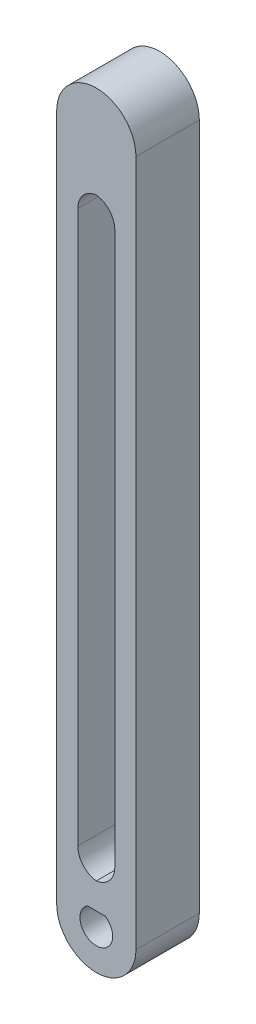
ISO-10303-21;
HEADER;
FILE_DESCRIPTION(('STEP AP214'),'2;1');
FILE_NAME('part.step','',(''),(''),'','','');
FILE_SCHEMA(('AUTOMOTIVE_DESIGN { 1 0 10303 214 1 1 1 1 }'));
ENDSEC;
DATA;
#1=APPLICATION_CONTEXT('core data for automotive mechanical design processes');
#2=APPLICATION_PROTOCOL_DEFINITION('international standard','automotive_design',2000,#1);
#3=PRODUCT_CONTEXT('',#1,'mechanical');
#4=PRODUCT('Part','Part','',(#3));
#5=PRODUCT_RELATED_PRODUCT_CATEGORY('part','',(#4));
#6=PRODUCT_DEFINITION_FORMATION('','',#4);
#7=PRODUCT_DEFINITION_CONTEXT('part definition',#1,'design');
#8=PRODUCT_DEFINITION('design','',#6,#7);
#9=PRODUCT_DEFINITION_SHAPE('','',#8);
#10=(LENGTH_UNIT() NAMED_UNIT(*) SI_UNIT(.MILLI.,.METRE.));
#11=(NAMED_UNIT(*) PLANE_ANGLE_UNIT() SI_UNIT($,.RADIAN.));
#12=(NAMED_UNIT(*) SI_UNIT($,.STERADIAN.) SOLID_ANGLE_UNIT());
#13=UNCERTAINTY_MEASURE_WITH_UNIT(LENGTH_MEASURE(1.E-05),#10,'distance_accuracy_value','');
#14=(GEOMETRIC_REPRESENTATION_CONTEXT(3) GLOBAL_UNCERTAINTY_ASSIGNED_CONTEXT((#13)) GLOBAL_UNIT_ASSIGNED_CONTEXT((#10,
#11,#12)) REPRESENTATION_CONTEXT('',''));
#15=CARTESIAN_POINT('',(0.,0.,0.));
#16=DIRECTION('',(0.,0.,1.));
#17=DIRECTION('',(1.,0.,0.));
#18=AXIS2_PLACEMENT_3D('',#15,#16,#17);
#19=CARTESIAN_POINT('',(1.85483870967741,102.58064516129,12.));
#20=DIRECTION('',(0.,0.,-1.));
#21=DIRECTION('',(-1.,0.,0.));
#22=AXIS2_PLACEMENT_3D('',#19,#20,#21);
#23=CYLINDRICAL_SURFACE('',#22,7.5);
#24=CARTESIAN_POINT('',(1.85483870967741,102.58064516129,0.));
#25=DIRECTION('',(0.,0.,1.));
#26=DIRECTION('',(-1.,0.,0.));
#27=AXIS2_PLACEMENT_3D('',#24,#25,#26);
#28=CIRCLE('',#27,7.5);
#29=CARTESIAN_POINT('',(9.35483870967741,102.58064516129,0.));
#30=VERTEX_POINT('',#29);
#31=CARTESIAN_POINT('',(-5.64516129032259,102.58064516129,0.));
#32=VERTEX_POINT('',#31);
#33=EDGE_CURVE('E151',#30,#32,#28,.T.);
#34=ORIENTED_EDGE('',*,*,#33,.T.);
#35=DIRECTION('',(0.,0.,-1.));
#36=VECTOR('',#35,1.);
#37=CARTESIAN_POINT('',(-5.64516129032259,102.58064516129,12.));
#38=LINE('',#37,#36);
#39=CARTESIAN_POINT('',(-5.64516129032259,102.58064516129,12.));
#40=VERTEX_POINT('',#39);
#41=EDGE_CURVE('E188',#40,#32,#38,.T.);
#42=ORIENTED_EDGE('',*,*,#41,.F.);
#43=CARTESIAN_POINT('',(1.85483870967741,102.58064516129,12.));
#44=DIRECTION('',(0.,0.,1.));
#45=DIRECTION('',(-1.,0.,0.));
#46=AXIS2_PLACEMENT_3D('',#43,#44,#45);
#47=CIRCLE('',#46,7.5);
#48=CARTESIAN_POINT('',(9.35483870967741,102.58064516129,12.));
#49=VERTEX_POINT('',#48);
#50=EDGE_CURVE('E162',#49,#40,#47,.T.);
#51=ORIENTED_EDGE('',*,*,#50,.F.);
#52=DIRECTION('',(0.,0.,-1.));
#53=VECTOR('',#52,1.);
#54=CARTESIAN_POINT('',(9.35483870967741,102.58064516129,12.));
#55=LINE('',#54,#53);
#56=EDGE_CURVE('E172',#49,#30,#55,.T.);
#57=ORIENTED_EDGE('',*,*,#56,.T.);
#58=EDGE_LOOP('',(#34,#42,#51,#57));
#59=FACE_BOUND('',#58,.T.);
#60=ADVANCED_FACE('F45',(#59),#23,.T.);
#61=CARTESIAN_POINT('',(-5.64516129032259,102.58064516129,12.));
#62=DIRECTION('',(1.,0.,0.));
#63=DIRECTION('',(0.,1.,0.));
#64=AXIS2_PLACEMENT_3D('',#61,#62,#63);
#65=PLANE('',#64);
#66=CARTESIAN_POINT('',(-5.64516129032259,78.768969581459,6.));
#67=DIRECTION('',(-1.,0.,0.));
#68=DIRECTION('',(0.,-1.,0.));
#69=AXIS2_PLACEMENT_3D('',#66,#67,#68);
#70=CIRCLE('',#69,5.15);
#71=CARTESIAN_POINT('',(-5.64516129032259,73.618969581459,6.));
#72=VERTEX_POINT('',#71);
#73=EDGE_CURVE('E420',#72,#72,#70,.T.);
#74=ORIENTED_EDGE('',*,*,#73,.F.);
#75=EDGE_LOOP('',(#74));
#76=FACE_BOUND('',#75,.T.);
#77=CARTESIAN_POINT('',(-5.64516129032258,53.768969581459,6.00000000000026));
#78=DIRECTION('',(-1.,0.,0.));
#79=DIRECTION('',(0.,-1.,0.));
#80=AXIS2_PLACEMENT_3D('',#77,#78,#79);
#81=CIRCLE('',#80,5.15);
#82=CARTESIAN_POINT('',(-5.64516129032258,48.618969581459,6.00000000000026));
#83=VERTEX_POINT('',#82);
#84=EDGE_CURVE('E423',#83,#83,#81,.T.);
#85=ORIENTED_EDGE('',*,*,#84,.F.);
#86=EDGE_LOOP('',(#85));
#87=FACE_BOUND('',#86,.T.);
#88=CARTESIAN_POINT('',(-5.64516129032258,28.768969581459,6.00000000000052));
#89=DIRECTION('',(-1.,0.,0.));
#90=DIRECTION('',(0.,-1.,0.));
#91=AXIS2_PLACEMENT_3D('',#88,#89,#90);
#92=CIRCLE('',#91,5.15);
#93=CARTESIAN_POINT('',(-5.64516129032258,23.618969581459,6.00000000000052));
#94=VERTEX_POINT('',#93);
#95=EDGE_CURVE('E219',#94,#94,#92,.T.);
#96=ORIENTED_EDGE('',*,*,#95,.F.);
#97=EDGE_LOOP('',(#96));
#98=FACE_BOUND('',#97,.T.);
#99=DIRECTION('',(0.,-1.,0.));
#100=VECTOR('',#99,1.);
#101=CARTESIAN_POINT('',(-5.64516129032259,102.58064516129,0.));
#102=LINE('',#101,#100);
#103=CARTESIAN_POINT('',(-5.64516129032258,-27.4193548387097,0.));
#104=VERTEX_POINT('',#103);
#105=EDGE_CURVE('E175',#32,#104,#102,.T.);
#106=ORIENTED_EDGE('',*,*,#105,.T.);
#107=DIRECTION('',(0.,0.,-1.));
#108=VECTOR('',#107,1.);
#109=CARTESIAN_POINT('',(-5.64516129032258,-27.4193548387097,12.));
#110=LINE('',#109,#108);
#111=CARTESIAN_POINT('',(-5.64516129032258,-27.4193548387097,12.));
#112=VERTEX_POINT('',#111);
#113=EDGE_CURVE('E185',#112,#104,#110,.T.);
#114=ORIENTED_EDGE('',*,*,#113,.F.);
#115=DIRECTION('',(0.,-1.,0.));
#116=VECTOR('',#115,1.);
#117=CARTESIAN_POINT('',(-5.64516129032259,102.58064516129,12.));
#118=LINE('',#117,#116);
#119=EDGE_CURVE('E165',#40,#112,#118,.T.);
#120=ORIENTED_EDGE('',*,*,#119,.F.);
#121=ORIENTED_EDGE('',*,*,#41,.T.);
#122=EDGE_LOOP('',(#106,#114,#120,#121));
#123=FACE_BOUND('',#122,.T.);
#124=ADVANCED_FACE('F269',(#76,#87,#98,#123),#65,.F.);
#125=CARTESIAN_POINT('',(1.85483870967743,-27.4193548387097,12.));
#126=DIRECTION('',(0.,0.,-1.));
#127=DIRECTION('',(-1.,0.,0.));
#128=AXIS2_PLACEMENT_3D('',#125,#126,#127);
#129=CYLINDRICAL_SURFACE('',#128,7.5);
#130=CARTESIAN_POINT('',(1.85483870967743,-27.4193548387097,0.));
#131=DIRECTION('',(0.,0.,1.));
#132=DIRECTION('',(1.,0.,0.));
#133=AXIS2_PLACEMENT_3D('',#130,#131,#132);
#134=CIRCLE('',#133,7.5);
#135=CARTESIAN_POINT('',(9.35483870967743,-27.4193548387097,0.));
#136=VERTEX_POINT('',#135);
#137=EDGE_CURVE('E177',#104,#136,#134,.T.);
#138=ORIENTED_EDGE('',*,*,#137,.T.);
#139=DIRECTION('',(0.,0.,-1.));
#140=VECTOR('',#139,1.);
#141=CARTESIAN_POINT('',(9.35483870967743,-27.4193548387097,12.));
#142=LINE('',#141,#140);
#143=CARTESIAN_POINT('',(9.35483870967743,-27.4193548387097,12.));
#144=VERTEX_POINT('',#143);
#145=EDGE_CURVE('E182',#144,#136,#142,.T.);
#146=ORIENTED_EDGE('',*,*,#145,.F.);
#147=CARTESIAN_POINT('',(1.85483870967743,-27.4193548387097,12.));
#148=DIRECTION('',(0.,0.,1.));
#149=DIRECTION('',(1.,0.,0.));
#150=AXIS2_PLACEMENT_3D('',#147,#148,#149);
#151=CIRCLE('',#150,7.5);
#152=EDGE_CURVE('E168',#112,#144,#151,.T.);
#153=ORIENTED_EDGE('',*,*,#152,.F.);
#154=ORIENTED_EDGE('',*,*,#113,.T.);
#155=EDGE_LOOP('',(#138,#146,#153,#154));
#156=FACE_BOUND('',#155,.T.);
#157=ADVANCED_FACE('F264',(#156),#129,.T.);
#158=CARTESIAN_POINT('',(9.35483870967741,102.58064516129,12.));
#159=DIRECTION('',(-1.,0.,0.));
#160=DIRECTION('',(0.,-1.,0.));
#161=AXIS2_PLACEMENT_3D('',#158,#159,#160);
#162=PLANE('',#161);
#163=DIRECTION('',(0.,1.,0.));
#164=VECTOR('',#163,1.);
#165=CARTESIAN_POINT('',(9.35483870967741,102.58064516129,0.));
#166=LINE('',#165,#164);
#167=EDGE_CURVE('E166',#136,#30,#166,.T.);
#168=ORIENTED_EDGE('',*,*,#167,.T.);
#169=ORIENTED_EDGE('',*,*,#56,.F.);
#170=DIRECTION('',(0.,1.,0.));
#171=VECTOR('',#170,1.);
#172=CARTESIAN_POINT('',(9.35483870967741,102.58064516129,12.));
#173=LINE('',#172,#171);
#174=EDGE_CURVE('E170',#144,#49,#173,.T.);
#175=ORIENTED_EDGE('',*,*,#174,.F.);
#176=ORIENTED_EDGE('',*,*,#145,.T.);
#177=EDGE_LOOP('',(#168,#169,#175,#176));
#178=FACE_BOUND('',#177,.T.);
#179=ADVANCED_FACE('F256',(#178),#162,.F.);
#180=CARTESIAN_POINT('',(1.85483870967741,102.58064516129,12.));
#181=DIRECTION('',(0.,0.,-1.));
#182=DIRECTION('',(-1.,0.,0.));
#183=AXIS2_PLACEMENT_3D('',#180,#181,#182);
#184=PLANE('',#183);
#185=DIRECTION('',(0.,1.,0.));
#186=VECTOR('',#185,1.);
#187=CARTESIAN_POINT('',(5.35483870967741,92.5806451612903,12.));
#188=LINE('',#187,#186);
#189=CARTESIAN_POINT('',(5.35483870967741,-15.9193548387097,12.));
#190=VERTEX_POINT('',#189);
#191=CARTESIAN_POINT('',(5.35483870967741,88.5806451612903,12.));
#192=VERTEX_POINT('',#191);
#193=EDGE_CURVE('E241',#190,#192,#188,.T.);
#194=ORIENTED_EDGE('',*,*,#193,.F.);
#195=CARTESIAN_POINT('',(1.35483870967741,-15.9193548387097,12.));
#196=DIRECTION('',(0.,0.,-1.));
#197=DIRECTION('',(-1.,0.,0.));
#198=AXIS2_PLACEMENT_3D('',#195,#196,#197);
#199=CIRCLE('',#198,4.);
#200=CARTESIAN_POINT('',(1.85483870967744,-19.8879818053066,12.));
#201=VERTEX_POINT('',#200);
#202=EDGE_CURVE('E205',#190,#201,#199,.T.);
#203=ORIENTED_EDGE('',*,*,#202,.T.);
#204=CARTESIAN_POINT('',(2.35483870967741,-15.9193548387097,12.));
#205=DIRECTION('',(0.,0.,-1.));
#206=DIRECTION('',(-1.,0.,0.));
#207=AXIS2_PLACEMENT_3D('',#204,#205,#206);
#208=CIRCLE('',#207,4.);
#209=CARTESIAN_POINT('',(-1.64516129032259,-15.9193548387097,12.));
#210=VERTEX_POINT('',#209);
#211=EDGE_CURVE('E201',#201,#210,#208,.T.);
#212=ORIENTED_EDGE('',*,*,#211,.T.);
#213=DIRECTION('',(0.,-1.,0.));
#214=VECTOR('',#213,1.);
#215=CARTESIAN_POINT('',(-1.64516129032259,92.5806451612903,12.));
#216=LINE('',#215,#214);
#217=CARTESIAN_POINT('',(-1.64516129032259,88.5806451612903,12.));
#218=VERTEX_POINT('',#217);
#219=EDGE_CURVE('E238',#218,#210,#216,.T.);
#220=ORIENTED_EDGE('',*,*,#219,.F.);
#221=CARTESIAN_POINT('',(2.35483870967741,88.5806451612903,12.));
#222=DIRECTION('',(0.,0.,-1.));
#223=DIRECTION('',(-1.,0.,0.));
#224=AXIS2_PLACEMENT_3D('',#221,#222,#223);
#225=CIRCLE('',#224,4.);
#226=CARTESIAN_POINT('',(1.85483870967741,92.5492721278872,12.));
#227=VERTEX_POINT('',#226);
#228=EDGE_CURVE('E54',#218,#227,#225,.T.);
#229=ORIENTED_EDGE('',*,*,#228,.T.);
#230=CARTESIAN_POINT('',(1.35483870967741,88.5806451612903,12.));
#231=DIRECTION('',(0.,0.,-1.));
#232=DIRECTION('',(-1.,0.,0.));
#233=AXIS2_PLACEMENT_3D('',#230,#231,#232);
#234=CIRCLE('',#233,4.);
#235=EDGE_CURVE('E209',#227,#192,#234,.T.);
#236=ORIENTED_EDGE('',*,*,#235,.T.);
#237=EDGE_LOOP('',(#194,#203,#212,#220,#229,#236));
#238=FACE_BOUND('',#237,.T.);
#239=CARTESIAN_POINT('',(1.85483870967743,-27.4193548387097,12.));
#240=DIRECTION('',(0.,0.,-1.));
#241=DIRECTION('',(-1.,0.,0.));
#242=AXIS2_PLACEMENT_3D('',#239,#240,#241);
#243=CIRCLE('',#242,3.1);
#244=CARTESIAN_POINT('',(3.54303301129084,-24.8193548387097,12.));
#245=VERTEX_POINT('',#244);
#246=CARTESIAN_POINT('',(0.166644408064011,-24.8193548387097,12.));
#247=VERTEX_POINT('',#246);
#248=EDGE_CURVE('E138',#245,#247,#243,.T.);
#249=ORIENTED_EDGE('',*,*,#248,.T.);
#250=DIRECTION('',(1.,0.,0.));
#251=VECTOR('',#250,1.);
#252=CARTESIAN_POINT('',(0.166644408064011,-24.8193548387097,12.));
#253=LINE('',#252,#251);
#254=EDGE_CURVE('E134',#247,#245,#253,.T.);
#255=ORIENTED_EDGE('',*,*,#254,.T.);
#256=EDGE_LOOP('',(#249,#255));
#257=FACE_BOUND('',#256,.T.);
#258=ORIENTED_EDGE('',*,*,#50,.T.);
#259=ORIENTED_EDGE('',*,*,#119,.T.);
#260=ORIENTED_EDGE('',*,*,#152,.T.);
#261=ORIENTED_EDGE('',*,*,#174,.T.);
#262=EDGE_LOOP('',(#258,#259,#260,#261));
#263=FACE_BOUND('',#262,.T.);
#264=ADVANCED_FACE('F136',(#238,#257,#263),#184,.F.);
#265=CARTESIAN_POINT('',(1.85483870967741,102.58064516129,0.));
#266=DIRECTION('',(0.,0.,-1.));
#267=DIRECTION('',(-1.,0.,0.));
#268=AXIS2_PLACEMENT_3D('',#265,#266,#267);
#269=PLANE('',#268);
#270=CARTESIAN_POINT('',(2.35483870967741,-15.9193548387097,0.));
#271=DIRECTION('',(0.,0.,-1.));
#272=DIRECTION('',(-1.,0.,0.));
#273=AXIS2_PLACEMENT_3D('',#270,#271,#272);
#274=CIRCLE('',#273,4.);
#275=CARTESIAN_POINT('',(-1.64516129032259,-15.9193548387097,0.));
#276=VERTEX_POINT('',#275);
#277=CARTESIAN_POINT('',(1.85483870967744,-19.8879818053066,0.));
#278=VERTEX_POINT('',#277);
#279=EDGE_CURVE('E203',#276,#278,#274,.F.);
#280=ORIENTED_EDGE('',*,*,#279,.T.);
#281=CARTESIAN_POINT('',(1.35483870967741,-15.9193548387097,0.));
#282=DIRECTION('',(0.,0.,-1.));
#283=DIRECTION('',(-1.,0.,0.));
#284=AXIS2_PLACEMENT_3D('',#281,#282,#283);
#285=CIRCLE('',#284,4.);
#286=CARTESIAN_POINT('',(5.35483870967741,-15.9193548387097,0.));
#287=VERTEX_POINT('',#286);
#288=EDGE_CURVE('E207',#278,#287,#285,.F.);
#289=ORIENTED_EDGE('',*,*,#288,.T.);
#290=DIRECTION('',(0.,1.,0.));
#291=VECTOR('',#290,1.);
#292=CARTESIAN_POINT('',(5.35483870967741,92.5806451612903,0.));
#293=LINE('',#292,#291);
#294=CARTESIAN_POINT('',(5.35483870967741,88.5806451612903,0.));
#295=VERTEX_POINT('',#294);
#296=EDGE_CURVE('E236',#287,#295,#293,.T.);
#297=ORIENTED_EDGE('',*,*,#296,.T.);
#298=CARTESIAN_POINT('',(1.35483870967741,88.5806451612903,0.));
#299=DIRECTION('',(0.,0.,-1.));
#300=DIRECTION('',(-1.,0.,0.));
#301=AXIS2_PLACEMENT_3D('',#298,#299,#300);
#302=CIRCLE('',#301,4.);
#303=CARTESIAN_POINT('',(1.85483870967741,92.5492721278872,0.));
#304=VERTEX_POINT('',#303);
#305=EDGE_CURVE('E61',#295,#304,#302,.F.);
#306=ORIENTED_EDGE('',*,*,#305,.T.);
#307=CARTESIAN_POINT('',(2.35483870967741,88.5806451612903,0.));
#308=DIRECTION('',(0.,0.,-1.));
#309=DIRECTION('',(-1.,0.,0.));
#310=AXIS2_PLACEMENT_3D('',#307,#308,#309);
#311=CIRCLE('',#310,4.);
#312=CARTESIAN_POINT('',(-1.64516129032259,88.5806451612903,0.));
#313=VERTEX_POINT('',#312);
#314=EDGE_CURVE('E11',#304,#313,#311,.F.);
#315=ORIENTED_EDGE('',*,*,#314,.T.);
#316=DIRECTION('',(0.,-1.,0.));
#317=VECTOR('',#316,1.);
#318=CARTESIAN_POINT('',(-1.64516129032259,92.5806451612903,0.));
#319=LINE('',#318,#317);
#320=EDGE_CURVE('E143',#313,#276,#319,.T.);
#321=ORIENTED_EDGE('',*,*,#320,.T.);
#322=EDGE_LOOP('',(#280,#289,#297,#306,#315,#321));
#323=FACE_BOUND('',#322,.T.);
#324=CARTESIAN_POINT('',(1.85483870967743,-27.4193548387097,0.));
#325=DIRECTION('',(0.,0.,-1.));
#326=DIRECTION('',(-1.,0.,0.));
#327=AXIS2_PLACEMENT_3D('',#324,#325,#326);
#328=CIRCLE('',#327,3.1);
#329=CARTESIAN_POINT('',(3.54303301129084,-24.8193548387097,0.));
#330=VERTEX_POINT('',#329);
#331=CARTESIAN_POINT('',(0.166644408064011,-24.8193548387097,0.));
#332=VERTEX_POINT('',#331);
#333=EDGE_CURVE('E152',#330,#332,#328,.T.);
#334=ORIENTED_EDGE('',*,*,#333,.F.);
#335=DIRECTION('',(1.,0.,0.));
#336=VECTOR('',#335,1.);
#337=CARTESIAN_POINT('',(1.85483870967741,-24.8193548387097,0.));
#338=LINE('',#337,#336);
#339=EDGE_CURVE('E156',#332,#330,#338,.T.);
#340=ORIENTED_EDGE('',*,*,#339,.F.);
#341=EDGE_LOOP('',(#334,#340));
#342=FACE_BOUND('',#341,.T.);
#343=ORIENTED_EDGE('',*,*,#33,.F.);
#344=ORIENTED_EDGE('',*,*,#167,.F.);
#345=ORIENTED_EDGE('',*,*,#137,.F.);
#346=ORIENTED_EDGE('',*,*,#105,.F.);
#347=EDGE_LOOP('',(#343,#344,#345,#346));
#348=FACE_BOUND('',#347,.T.);
#349=ADVANCED_FACE('F230',(#323,#342,#348),#269,.T.);
#350=CARTESIAN_POINT('',(1.85483870967743,-27.4193548387097,-23.));
#351=DIRECTION('',(0.,0.,1.));
#352=DIRECTION('',(1.,0.,0.));
#353=AXIS2_PLACEMENT_3D('',#350,#351,#352);
#354=CYLINDRICAL_SURFACE('',#353,3.1);
#355=DIRECTION('',(0.,0.,1.));
#356=VECTOR('',#355,1.);
#357=CARTESIAN_POINT('',(3.54303301129084,-24.8193548387097,-23.));
#358=LINE('',#357,#356);
#359=EDGE_CURVE('E142',#330,#245,#358,.T.);
#360=ORIENTED_EDGE('',*,*,#359,.F.);
#361=ORIENTED_EDGE('',*,*,#333,.T.);
#362=DIRECTION('',(0.,0.,1.));
#363=VECTOR('',#362,1.);
#364=CARTESIAN_POINT('',(0.166644408064011,-24.8193548387097,-23.));
#365=LINE('',#364,#363);
#366=EDGE_CURVE('E150',#332,#247,#365,.T.);
#367=ORIENTED_EDGE('',*,*,#366,.T.);
#368=ORIENTED_EDGE('',*,*,#248,.F.);
#369=EDGE_LOOP('',(#360,#361,#367,#368));
#370=FACE_BOUND('',#369,.T.);
#371=ADVANCED_FACE('F147',(#370),#354,.F.);
#372=CARTESIAN_POINT('',(0.166644408064011,-24.8193548387097,-23.));
#373=DIRECTION('',(0.,1.,0.));
#374=DIRECTION('',(0.,0.,1.));
#375=AXIS2_PLACEMENT_3D('',#372,#373,#374);
#376=PLANE('',#375);
#377=ORIENTED_EDGE('',*,*,#359,.T.);
#378=ORIENTED_EDGE('',*,*,#254,.F.);
#379=ORIENTED_EDGE('',*,*,#366,.F.);
#380=ORIENTED_EDGE('',*,*,#339,.T.);
#381=EDGE_LOOP('',(#377,#378,#379,#380));
#382=FACE_BOUND('',#381,.T.);
#383=ADVANCED_FACE('F154',(#382),#376,.F.);
#384=CARTESIAN_POINT('',(-1.64516129032259,92.5806451612903,0.));
#385=DIRECTION('',(-1.,0.,0.));
#386=DIRECTION('',(0.,-1.,0.));
#387=AXIS2_PLACEMENT_3D('',#384,#385,#386);
#388=PLANE('',#387);
#389=ORIENTED_EDGE('',*,*,#219,.T.);
#390=DIRECTION('',(0.,0.,1.));
#391=VECTOR('',#390,1.);
#392=CARTESIAN_POINT('',(-1.64516129032259,-15.9193548387097,0.));
#393=LINE('',#392,#391);
#394=EDGE_CURVE('E193',#210,#276,#393,.F.);
#395=ORIENTED_EDGE('',*,*,#394,.T.);
#396=ORIENTED_EDGE('',*,*,#320,.F.);
#397=DIRECTION('',(0.,0.,1.));
#398=VECTOR('',#397,1.);
#399=CARTESIAN_POINT('',(-1.64516129032259,88.5806451612903,12.));
#400=LINE('',#399,#398);
#401=EDGE_CURVE('E191',#313,#218,#400,.T.);
#402=ORIENTED_EDGE('',*,*,#401,.T.);
#403=EDGE_LOOP('',(#389,#395,#396,#402));
#404=FACE_BOUND('',#403,.T.);
#405=ADVANCED_FACE('F234',(#404),#388,.F.);
#406=CARTESIAN_POINT('',(5.35483870967741,92.5806451612903,0.));
#407=DIRECTION('',(1.,0.,0.));
#408=DIRECTION('',(0.,0.,-1.));
#409=AXIS2_PLACEMENT_3D('',#406,#407,#408);
#410=PLANE('',#409);
#411=ORIENTED_EDGE('',*,*,#296,.F.);
#412=DIRECTION('',(0.,0.,1.));
#413=VECTOR('',#412,1.);
#414=CARTESIAN_POINT('',(5.35483870967741,-15.9193548387097,12.));
#415=LINE('',#414,#413);
#416=EDGE_CURVE('E199',#287,#190,#415,.T.);
#417=ORIENTED_EDGE('',*,*,#416,.T.);
#418=ORIENTED_EDGE('',*,*,#193,.T.);
#419=DIRECTION('',(0.,0.,1.));
#420=VECTOR('',#419,1.);
#421=CARTESIAN_POINT('',(5.35483870967741,88.5806451612903,0.));
#422=LINE('',#421,#420);
#423=EDGE_CURVE('E196',#192,#295,#422,.F.);
#424=ORIENTED_EDGE('',*,*,#423,.T.);
#425=EDGE_LOOP('',(#411,#417,#418,#424));
#426=FACE_BOUND('',#425,.T.);
#427=ADVANCED_FACE('F254',(#426),#410,.F.);
#428=CARTESIAN_POINT('',(-3.64516129032258,28.768969581459,6.00000000000052));
#429=DIRECTION('',(-1.,0.,0.));
#430=DIRECTION('',(0.,-1.,0.));
#431=AXIS2_PLACEMENT_3D('',#428,#429,#430);
#432=CYLINDRICAL_SURFACE('',#431,5.15);
#433=CARTESIAN_POINT('',(-3.64516129032258,28.768969581459,6.00000000000052));
#434=DIRECTION('',(-1.,0.,0.));
#435=DIRECTION('',(0.,-1.,0.));
#436=AXIS2_PLACEMENT_3D('',#433,#434,#435);
#437=CIRCLE('',#436,5.15);
#438=CARTESIAN_POINT('',(-3.64516129032258,23.618969581459,6.00000000000052));
#439=VERTEX_POINT('',#438);
#440=EDGE_CURVE('E214',#439,#439,#437,.T.);
#441=ORIENTED_EDGE('',*,*,#440,.F.);
#442=EDGE_LOOP('',(#441));
#443=FACE_BOUND('',#442,.T.);
#444=ORIENTED_EDGE('',*,*,#95,.T.);
#445=EDGE_LOOP('',(#444));
#446=FACE_BOUND('',#445,.T.);
#447=ADVANCED_FACE('F308',(#443,#446),#432,.F.);
#448=CARTESIAN_POINT('',(-3.64516129032258,28.768969581459,6.00000000000052));
#449=DIRECTION('',(-1.,0.,0.));
#450=DIRECTION('',(0.,-1.,0.));
#451=AXIS2_PLACEMENT_3D('',#448,#449,#450);
#452=PLANE('',#451);
#453=ORIENTED_EDGE('',*,*,#440,.T.);
#454=EDGE_LOOP('',(#453));
#455=FACE_BOUND('',#454,.T.);
#456=ADVANCED_FACE('F357',(#455),#452,.T.);
#457=CARTESIAN_POINT('',(-3.64516129032258,53.768969581459,6.00000000000026));
#458=DIRECTION('',(-1.,0.,0.));
#459=DIRECTION('',(0.,-1.,0.));
#460=AXIS2_PLACEMENT_3D('',#457,#458,#459);
#461=CYLINDRICAL_SURFACE('',#460,5.15);
#462=CARTESIAN_POINT('',(-3.64516129032258,53.768969581459,6.00000000000026));
#463=DIRECTION('',(-1.,0.,0.));
#464=DIRECTION('',(0.,-1.,0.));
#465=AXIS2_PLACEMENT_3D('',#462,#463,#464);
#466=CIRCLE('',#465,5.15);
#467=CARTESIAN_POINT('',(-3.64516129032258,48.618969581459,6.00000000000026));
#468=VERTEX_POINT('',#467);
#469=EDGE_CURVE('E428',#468,#468,#466,.T.);
#470=ORIENTED_EDGE('',*,*,#469,.F.);
#471=EDGE_LOOP('',(#470));
#472=FACE_BOUND('',#471,.T.);
#473=ORIENTED_EDGE('',*,*,#84,.T.);
#474=EDGE_LOOP('',(#473));
#475=FACE_BOUND('',#474,.T.);
#476=ADVANCED_FACE('F366',(#472,#475),#461,.F.);
#477=CARTESIAN_POINT('',(-3.64516129032258,53.768969581459,6.00000000000026));
#478=DIRECTION('',(-1.,0.,0.));
#479=DIRECTION('',(0.,-1.,0.));
#480=AXIS2_PLACEMENT_3D('',#477,#478,#479);
#481=PLANE('',#480);
#482=ORIENTED_EDGE('',*,*,#469,.T.);
#483=EDGE_LOOP('',(#482));
#484=FACE_BOUND('',#483,.T.);
#485=ADVANCED_FACE('F375',(#484),#481,.T.);
#486=CARTESIAN_POINT('',(-3.64516129032259,78.768969581459,6.));
#487=DIRECTION('',(-1.,0.,0.));
#488=DIRECTION('',(0.,-1.,0.));
#489=AXIS2_PLACEMENT_3D('',#486,#487,#488);
#490=CYLINDRICAL_SURFACE('',#489,5.15);
#491=CARTESIAN_POINT('',(-3.64516129032259,78.768969581459,6.));
#492=DIRECTION('',(-1.,0.,0.));
#493=DIRECTION('',(0.,-1.,0.));
#494=AXIS2_PLACEMENT_3D('',#491,#492,#493);
#495=CIRCLE('',#494,5.15);
#496=CARTESIAN_POINT('',(-3.64516129032259,73.618969581459,6.));
#497=VERTEX_POINT('',#496);
#498=EDGE_CURVE('E244',#497,#497,#495,.T.);
#499=ORIENTED_EDGE('',*,*,#498,.F.);
#500=EDGE_LOOP('',(#499));
#501=FACE_BOUND('',#500,.T.);
#502=ORIENTED_EDGE('',*,*,#73,.T.);
#503=EDGE_LOOP('',(#502));
#504=FACE_BOUND('',#503,.T.);
#505=ADVANCED_FACE('F384',(#501,#504),#490,.F.);
#506=CARTESIAN_POINT('',(-3.64516129032259,78.768969581459,6.));
#507=DIRECTION('',(-1.,0.,0.));
#508=DIRECTION('',(0.,-1.,0.));
#509=AXIS2_PLACEMENT_3D('',#506,#507,#508);
#510=PLANE('',#509);
#511=ORIENTED_EDGE('',*,*,#498,.T.);
#512=EDGE_LOOP('',(#511));
#513=FACE_BOUND('',#512,.T.);
#514=ADVANCED_FACE('F283',(#513),#510,.T.);
#515=CARTESIAN_POINT('',(1.35483870967741,-15.9193548387097,0.));
#516=DIRECTION('',(0.,0.,-1.));
#517=DIRECTION('',(-1.,0.,0.));
#518=AXIS2_PLACEMENT_3D('',#515,#516,#517);
#519=CYLINDRICAL_SURFACE('',#518,4.);
#520=ORIENTED_EDGE('',*,*,#416,.F.);
#521=ORIENTED_EDGE('',*,*,#288,.F.);
#522=DIRECTION('',(0.,0.,-1.));
#523=VECTOR('',#522,1.);
#524=CARTESIAN_POINT('',(1.85483870967744,-19.8879818053066,6.));
#525=LINE('',#524,#523);
#526=EDGE_CURVE('E212',#201,#278,#525,.T.);
#527=ORIENTED_EDGE('',*,*,#526,.F.);
#528=ORIENTED_EDGE('',*,*,#202,.F.);
#529=EDGE_LOOP('',(#520,#521,#527,#528));
#530=FACE_BOUND('',#529,.T.);
#531=ADVANCED_FACE('F250',(#530),#519,.F.);
#532=CARTESIAN_POINT('',(2.35483870967741,-15.9193548387097,0.));
#533=DIRECTION('',(0.,0.,-1.));
#534=DIRECTION('',(-1.,0.,0.));
#535=AXIS2_PLACEMENT_3D('',#532,#533,#534);
#536=CYLINDRICAL_SURFACE('',#535,4.);
#537=ORIENTED_EDGE('',*,*,#279,.F.);
#538=ORIENTED_EDGE('',*,*,#394,.F.);
#539=ORIENTED_EDGE('',*,*,#211,.F.);
#540=ORIENTED_EDGE('',*,*,#526,.T.);
#541=EDGE_LOOP('',(#537,#538,#539,#540));
#542=FACE_BOUND('',#541,.T.);
#543=ADVANCED_FACE('F245',(#542),#536,.F.);
#544=CARTESIAN_POINT('',(2.35483870967741,88.5806451612903,0.));
#545=DIRECTION('',(0.,0.,-1.));
#546=DIRECTION('',(-1.,0.,0.));
#547=AXIS2_PLACEMENT_3D('',#544,#545,#546);
#548=CYLINDRICAL_SURFACE('',#547,4.);
#549=ORIENTED_EDGE('',*,*,#401,.F.);
#550=ORIENTED_EDGE('',*,*,#314,.F.);
#551=DIRECTION('',(0.,0.,-1.));
#552=VECTOR('',#551,1.);
#553=CARTESIAN_POINT('',(1.85483870967741,92.5492721278872,6.));
#554=LINE('',#553,#552);
#555=EDGE_CURVE('E49',#227,#304,#554,.T.);
#556=ORIENTED_EDGE('',*,*,#555,.F.);
#557=ORIENTED_EDGE('',*,*,#228,.F.);
#558=EDGE_LOOP('',(#549,#550,#556,#557));
#559=FACE_BOUND('',#558,.T.);
#560=ADVANCED_FACE('F47',(#559),#548,.F.);
#561=CARTESIAN_POINT('',(1.35483870967741,88.5806451612903,0.));
#562=DIRECTION('',(0.,0.,-1.));
#563=DIRECTION('',(-1.,0.,0.));
#564=AXIS2_PLACEMENT_3D('',#561,#562,#563);
#565=CYLINDRICAL_SURFACE('',#564,4.);
#566=ORIENTED_EDGE('',*,*,#305,.F.);
#567=ORIENTED_EDGE('',*,*,#423,.F.);
#568=ORIENTED_EDGE('',*,*,#235,.F.);
#569=ORIENTED_EDGE('',*,*,#555,.T.);
#570=EDGE_LOOP('',(#566,#567,#568,#569));
#571=FACE_BOUND('',#570,.T.);
#572=ADVANCED_FACE('F224',(#571),#565,.F.);
#573=CLOSED_SHELL('',(#60,#124,#157,#179,#264,#349,#371,#383,#405,#427,#447,#456,#476,#485,#505,
#514,#531,#543,#560,#572));
#574=MANIFOLD_SOLID_BREP('B2',#573);
#575=ADVANCED_BREP_SHAPE_REPRESENTATION('',(#18,#574),#14);
#576=SHAPE_DEFINITION_REPRESENTATION(#9,#575);
ENDSEC;
END-ISO-10303-21;
